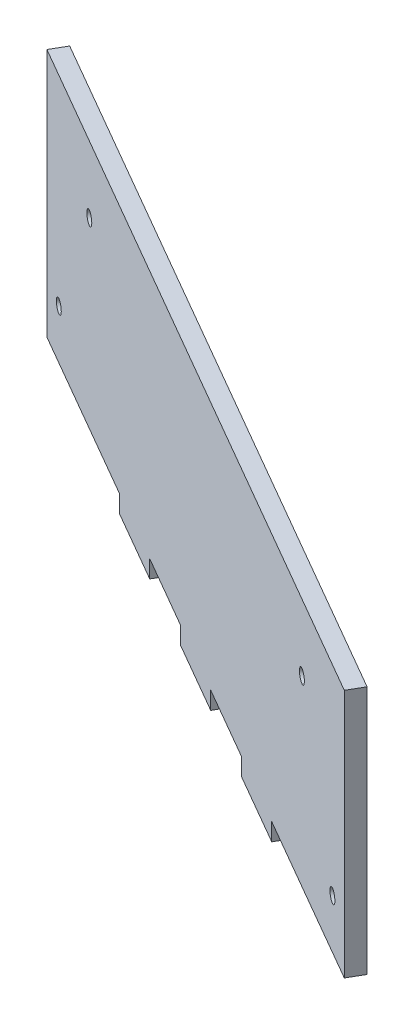
ISO-10303-21;
HEADER;
FILE_DESCRIPTION(('STEP AP214'),'2;1');
FILE_NAME('part.step','',(''),(''),'','','');
FILE_SCHEMA(('AUTOMOTIVE_DESIGN { 1 0 10303 214 1 1 1 1 }'));
ENDSEC;
DATA;
#1=APPLICATION_CONTEXT('core data for automotive mechanical design processes');
#2=APPLICATION_PROTOCOL_DEFINITION('international standard','automotive_design',2000,#1);
#3=PRODUCT_CONTEXT('',#1,'mechanical');
#4=PRODUCT('Part','Part','',(#3));
#5=PRODUCT_RELATED_PRODUCT_CATEGORY('part','',(#4));
#6=PRODUCT_DEFINITION_FORMATION('','',#4);
#7=PRODUCT_DEFINITION_CONTEXT('part definition',#1,'design');
#8=PRODUCT_DEFINITION('design','',#6,#7);
#9=PRODUCT_DEFINITION_SHAPE('','',#8);
#10=(LENGTH_UNIT() NAMED_UNIT(*) SI_UNIT(.MILLI.,.METRE.));
#11=(NAMED_UNIT(*) PLANE_ANGLE_UNIT() SI_UNIT($,.RADIAN.));
#12=(NAMED_UNIT(*) SI_UNIT($,.STERADIAN.) SOLID_ANGLE_UNIT());
#13=UNCERTAINTY_MEASURE_WITH_UNIT(LENGTH_MEASURE(1.E-05),#10,'distance_accuracy_value','');
#14=(GEOMETRIC_REPRESENTATION_CONTEXT(3) GLOBAL_UNCERTAINTY_ASSIGNED_CONTEXT((#13)) GLOBAL_UNIT_ASSIGNED_CONTEXT((#10,
#11,#12)) REPRESENTATION_CONTEXT('',''));
#15=CARTESIAN_POINT('',(0.,0.,0.));
#16=DIRECTION('',(0.,0.,1.));
#17=DIRECTION('',(1.,0.,0.));
#18=AXIS2_PLACEMENT_3D('',#15,#16,#17);
#19=CARTESIAN_POINT('',(187.283493649054,-89.75,-80.6153810567664));
#20=DIRECTION('',(0.866025403784438,0.,0.500000000000001));
#21=DIRECTION('',(0.500000000000001,0.,-0.866025403784438));
#22=AXIS2_PLACEMENT_3D('',#19,#20,#21);
#23=PLANE('',#22);
#24=DIRECTION('',(0.,-1.,0.));
#25=VECTOR('',#24,1.);
#26=CARTESIAN_POINT('',(189.783493649054,-89.75,-84.9455080756886));
#27=LINE('',#26,#25);
#28=CARTESIAN_POINT('',(189.783493649054,-15.,-84.9455080756886));
#29=VERTEX_POINT('',#28);
#30=CARTESIAN_POINT('',(189.783493649054,-89.75,-84.9455080756886));
#31=VERTEX_POINT('',#30);
#32=EDGE_CURVE('E141',#29,#31,#27,.T.);
#33=ORIENTED_EDGE('',*,*,#32,.F.);
#34=DIRECTION('',(0.500000000000001,0.,-0.866025403784438));
#35=VECTOR('',#34,1.);
#36=CARTESIAN_POINT('',(187.283493649054,-15.,-80.6153810567664));
#37=LINE('',#36,#35);
#38=CARTESIAN_POINT('',(187.283493649054,-15.,-80.6153810567664));
#39=VERTEX_POINT('',#38);
#40=EDGE_CURVE('E11',#39,#29,#37,.T.);
#41=ORIENTED_EDGE('',*,*,#40,.F.);
#42=DIRECTION('',(0.,-1.,0.));
#43=VECTOR('',#42,1.);
#44=CARTESIAN_POINT('',(187.283493649054,-89.75,-80.6153810567664));
#45=LINE('',#44,#43);
#46=CARTESIAN_POINT('',(187.283493649054,-89.75,-80.6153810567664));
#47=VERTEX_POINT('',#46);
#48=EDGE_CURVE('E164',#39,#47,#45,.T.);
#49=ORIENTED_EDGE('',*,*,#48,.T.);
#50=DIRECTION('',(0.500000000000001,0.,-0.866025403784438));
#51=VECTOR('',#50,1.);
#52=CARTESIAN_POINT('',(187.283493649054,-89.75,-80.6153810567664));
#53=LINE('',#52,#51);
#54=EDGE_CURVE('E90',#47,#31,#53,.T.);
#55=ORIENTED_EDGE('',*,*,#54,.T.);
#56=EDGE_LOOP('',(#33,#41,#49,#55));
#57=FACE_BOUND('',#56,.T.);
#58=ADVANCED_FACE('F33',(#57),#23,.T.);
#59=CARTESIAN_POINT('',(187.283493649054,-15.,-80.6153810567664));
#60=DIRECTION('',(0.,1.,0.));
#61=DIRECTION('',(0.,0.,1.));
#62=AXIS2_PLACEMENT_3D('',#59,#60,#61);
#63=PLANE('',#62);
#64=DIRECTION('',(0.866025403784438,0.,0.500000000000001));
#65=VECTOR('',#64,1.);
#66=CARTESIAN_POINT('',(189.783493649054,-15.,-84.9455080756886));
#67=LINE('',#66,#65);
#68=CARTESIAN_POINT('',(-21.3267788936041,-15.,-206.830080756888));
#69=VERTEX_POINT('',#68);
#70=EDGE_CURVE('E162',#69,#29,#67,.T.);
#71=ORIENTED_EDGE('',*,*,#70,.F.);
#72=DIRECTION('',(0.500000000000001,0.,-0.866025403784438));
#73=VECTOR('',#72,1.);
#74=CARTESIAN_POINT('',(-23.8267788936041,-15.,-202.499953737965));
#75=LINE('',#74,#73);
#76=CARTESIAN_POINT('',(-23.8267788936041,-15.,-202.499953737965));
#77=VERTEX_POINT('',#76);
#78=EDGE_CURVE('E186',#77,#69,#75,.T.);
#79=ORIENTED_EDGE('',*,*,#78,.F.);
#80=DIRECTION('',(0.866025403784438,0.,0.500000000000001));
#81=VECTOR('',#80,1.);
#82=CARTESIAN_POINT('',(187.283493649054,-15.,-80.6153810567664));
#83=LINE('',#82,#81);
#84=EDGE_CURVE('E139',#77,#39,#83,.T.);
#85=ORIENTED_EDGE('',*,*,#84,.T.);
#86=ORIENTED_EDGE('',*,*,#40,.T.);
#87=EDGE_LOOP('',(#71,#79,#85,#86));
#88=FACE_BOUND('',#87,.T.);
#89=ADVANCED_FACE('F218',(#88),#63,.T.);
#90=CARTESIAN_POINT('',(92.4670723846508,-95.,-135.357667397367));
#91=DIRECTION('',(0.,-1.,0.));
#92=DIRECTION('',(0.,0.,-1.));
#93=AXIS2_PLACEMENT_3D('',#90,#91,#92);
#94=PLANE('',#93);
#95=DIRECTION('',(-0.866025403784439,0.,-0.5));
#96=VECTOR('',#95,1.);
#97=CARTESIAN_POINT('',(94.9670723846508,-95.,-139.687794416289));
#98=LINE('',#97,#96);
#99=CARTESIAN_POINT('',(94.9670723846508,-95.,-139.687794416289));
#100=VERTEX_POINT('',#99);
#101=CARTESIAN_POINT('',(73.489642370799,-95.,-152.087794416287));
#102=VERTEX_POINT('',#101);
#103=EDGE_CURVE('E159',#100,#102,#98,.T.);
#104=ORIENTED_EDGE('',*,*,#103,.F.);
#105=DIRECTION('',(0.500000000000001,0.,-0.866025403784438));
#106=VECTOR('',#105,1.);
#107=CARTESIAN_POINT('',(92.4670723846508,-95.,-135.357667397367));
#108=LINE('',#107,#106);
#109=CARTESIAN_POINT('',(92.4670723846508,-95.,-135.357667397367));
#110=VERTEX_POINT('',#109);
#111=EDGE_CURVE('E42',#110,#100,#108,.T.);
#112=ORIENTED_EDGE('',*,*,#111,.F.);
#113=DIRECTION('',(-0.866025403784439,0.,-0.5));
#114=VECTOR('',#113,1.);
#115=CARTESIAN_POINT('',(92.4670723846508,-95.,-135.357667397367));
#116=LINE('',#115,#114);
#117=CARTESIAN_POINT('',(70.989642370799,-95.,-147.757667397365));
#118=VERTEX_POINT('',#117);
#119=EDGE_CURVE('E129',#110,#118,#116,.T.);
#120=ORIENTED_EDGE('',*,*,#119,.T.);
#121=DIRECTION('',(0.500000000000001,0.,-0.866025403784438));
#122=VECTOR('',#121,1.);
#123=CARTESIAN_POINT('',(70.989642370799,-95.,-147.757667397365));
#124=LINE('',#123,#122);
#125=EDGE_CURVE('E228',#118,#102,#124,.T.);
#126=ORIENTED_EDGE('',*,*,#125,.T.);
#127=EDGE_LOOP('',(#104,#112,#120,#126));
#128=FACE_BOUND('',#127,.T.);
#129=ADVANCED_FACE('F310',(#128),#94,.T.);
#130=CARTESIAN_POINT('',(92.4670723846508,-89.75,-135.357667397367));
#131=DIRECTION('',(0.866025403784438,0.,0.500000000000001));
#132=DIRECTION('',(0.500000000000001,0.,-0.866025403784438));
#133=AXIS2_PLACEMENT_3D('',#130,#131,#132);
#134=PLANE('',#133);
#135=DIRECTION('',(0.,-1.,0.));
#136=VECTOR('',#135,1.);
#137=CARTESIAN_POINT('',(94.9670723846508,-89.75,-139.687794416289));
#138=LINE('',#137,#136);
#139=CARTESIAN_POINT('',(94.9670723846508,-89.75,-139.687794416289));
#140=VERTEX_POINT('',#139);
#141=EDGE_CURVE('E112',#140,#100,#138,.T.);
#142=ORIENTED_EDGE('',*,*,#141,.F.);
#143=DIRECTION('',(0.500000000000001,0.,-0.866025403784438));
#144=VECTOR('',#143,1.);
#145=CARTESIAN_POINT('',(92.4670723846508,-89.75,-135.357667397367));
#146=LINE('',#145,#144);
#147=CARTESIAN_POINT('',(92.4670723846508,-89.75,-135.357667397367));
#148=VERTEX_POINT('',#147);
#149=EDGE_CURVE('E107',#148,#140,#146,.T.);
#150=ORIENTED_EDGE('',*,*,#149,.F.);
#151=DIRECTION('',(0.,-1.,0.));
#152=VECTOR('',#151,1.);
#153=CARTESIAN_POINT('',(92.4670723846508,-89.75,-135.357667397367));
#154=LINE('',#153,#152);
#155=EDGE_CURVE('E110',#148,#110,#154,.T.);
#156=ORIENTED_EDGE('',*,*,#155,.T.);
#157=ORIENTED_EDGE('',*,*,#111,.T.);
#158=EDGE_LOOP('',(#142,#150,#156,#157));
#159=FACE_BOUND('',#158,.T.);
#160=ADVANCED_FACE('F109',(#159),#134,.T.);
#161=CARTESIAN_POINT('',(114.290912560019,-89.75,-122.757667397367));
#162=DIRECTION('',(0.,-1.,0.));
#163=DIRECTION('',(0.,0.,-1.));
#164=AXIS2_PLACEMENT_3D('',#161,#162,#163);
#165=PLANE('',#164);
#166=DIRECTION('',(-0.866025403784438,0.,-0.500000000000001));
#167=VECTOR('',#166,1.);
#168=CARTESIAN_POINT('',(116.790912560019,-89.75,-127.087794416289));
#169=LINE('',#168,#167);
#170=CARTESIAN_POINT('',(116.790912560019,-89.75,-127.087794416289));
#171=VERTEX_POINT('',#170);
#172=EDGE_CURVE('E156',#171,#140,#169,.T.);
#173=ORIENTED_EDGE('',*,*,#172,.F.);
#174=DIRECTION('',(0.500000000000001,0.,-0.866025403784438));
#175=VECTOR('',#174,1.);
#176=CARTESIAN_POINT('',(114.290912560019,-89.75,-122.757667397367));
#177=LINE('',#176,#175);
#178=CARTESIAN_POINT('',(114.290912560019,-89.75,-122.757667397367));
#179=VERTEX_POINT('',#178);
#180=EDGE_CURVE('E117',#179,#171,#177,.T.);
#181=ORIENTED_EDGE('',*,*,#180,.F.);
#182=DIRECTION('',(-0.866025403784438,0.,-0.500000000000001));
#183=VECTOR('',#182,1.);
#184=CARTESIAN_POINT('',(114.290912560019,-89.75,-122.757667397367));
#185=LINE('',#184,#183);
#186=EDGE_CURVE('E125',#179,#148,#185,.T.);
#187=ORIENTED_EDGE('',*,*,#186,.T.);
#188=ORIENTED_EDGE('',*,*,#149,.T.);
#189=EDGE_LOOP('',(#173,#181,#187,#188));
#190=FACE_BOUND('',#189,.T.);
#191=ADVANCED_FACE('F131',(#190),#165,.T.);
#192=CARTESIAN_POINT('',(114.290912560019,-95.,-122.757667397367));
#193=DIRECTION('',(-0.866025403784438,0.,-0.500000000000001));
#194=DIRECTION('',(-0.500000000000001,0.,0.866025403784438));
#195=AXIS2_PLACEMENT_3D('',#192,#193,#194);
#196=PLANE('',#195);
#197=DIRECTION('',(0.,1.,0.));
#198=VECTOR('',#197,1.);
#199=CARTESIAN_POINT('',(116.790912560019,-95.,-127.087794416289));
#200=LINE('',#199,#198);
#201=CARTESIAN_POINT('',(116.790912560019,-95.,-127.087794416289));
#202=VERTEX_POINT('',#201);
#203=EDGE_CURVE('E153',#202,#171,#200,.T.);
#204=ORIENTED_EDGE('',*,*,#203,.F.);
#205=DIRECTION('',(0.500000000000001,0.,-0.866025403784438));
#206=VECTOR('',#205,1.);
#207=CARTESIAN_POINT('',(114.290912560019,-95.,-122.757667397367));
#208=LINE('',#207,#206);
#209=CARTESIAN_POINT('',(114.290912560019,-95.,-122.757667397367));
#210=VERTEX_POINT('',#209);
#211=EDGE_CURVE('E168',#210,#202,#208,.T.);
#212=ORIENTED_EDGE('',*,*,#211,.F.);
#213=DIRECTION('',(0.,1.,0.));
#214=VECTOR('',#213,1.);
#215=CARTESIAN_POINT('',(114.290912560019,-95.,-122.757667397367));
#216=LINE('',#215,#214);
#217=EDGE_CURVE('E132',#210,#179,#216,.T.);
#218=ORIENTED_EDGE('',*,*,#217,.T.);
#219=ORIENTED_EDGE('',*,*,#180,.T.);
#220=EDGE_LOOP('',(#204,#212,#218,#219));
#221=FACE_BOUND('',#220,.T.);
#222=ADVANCED_FACE('F363',(#221),#196,.T.);
#223=CARTESIAN_POINT('',(135.768342573873,-95.,-110.357667397367));
#224=DIRECTION('',(0.,-1.,0.));
#225=DIRECTION('',(0.,0.,-1.));
#226=AXIS2_PLACEMENT_3D('',#223,#224,#225);
#227=PLANE('',#226);
#228=DIRECTION('',(-0.866025403784438,0.,-0.500000000000001));
#229=VECTOR('',#228,1.);
#230=CARTESIAN_POINT('',(138.268342573873,-95.,-114.687794416289));
#231=LINE('',#230,#229);
#232=CARTESIAN_POINT('',(138.268342573873,-95.,-114.687794416289));
#233=VERTEX_POINT('',#232);
#234=EDGE_CURVE('E150',#233,#202,#231,.T.);
#235=ORIENTED_EDGE('',*,*,#234,.F.);
#236=DIRECTION('',(0.500000000000001,0.,-0.866025403784438));
#237=VECTOR('',#236,1.);
#238=CARTESIAN_POINT('',(135.768342573873,-95.,-110.357667397367));
#239=LINE('',#238,#237);
#240=CARTESIAN_POINT('',(135.768342573873,-95.,-110.357667397367));
#241=VERTEX_POINT('',#240);
#242=EDGE_CURVE('E170',#241,#233,#239,.T.);
#243=ORIENTED_EDGE('',*,*,#242,.F.);
#244=DIRECTION('',(-0.866025403784438,0.,-0.500000000000001));
#245=VECTOR('',#244,1.);
#246=CARTESIAN_POINT('',(135.768342573873,-95.,-110.357667397367));
#247=LINE('',#246,#245);
#248=EDGE_CURVE('E134',#241,#210,#247,.T.);
#249=ORIENTED_EDGE('',*,*,#248,.T.);
#250=ORIENTED_EDGE('',*,*,#211,.T.);
#251=EDGE_LOOP('',(#235,#243,#249,#250));
#252=FACE_BOUND('',#251,.T.);
#253=ADVANCED_FACE('F201',(#252),#227,.T.);
#254=CARTESIAN_POINT('',(135.768342573873,-95.,-110.357667397367));
#255=DIRECTION('',(0.866025403784438,0.,0.500000000000001));
#256=DIRECTION('',(0.500000000000001,0.,-0.866025403784438));
#257=AXIS2_PLACEMENT_3D('',#254,#255,#256);
#258=PLANE('',#257);
#259=DIRECTION('',(0.,-1.,0.));
#260=VECTOR('',#259,1.);
#261=CARTESIAN_POINT('',(138.268342573873,-95.,-114.687794416289));
#262=LINE('',#261,#260);
#263=CARTESIAN_POINT('',(138.268342573873,-89.75,-114.687794416289));
#264=VERTEX_POINT('',#263);
#265=EDGE_CURVE('E147',#264,#233,#262,.T.);
#266=ORIENTED_EDGE('',*,*,#265,.F.);
#267=DIRECTION('',(0.500000000000001,0.,-0.866025403784438));
#268=VECTOR('',#267,1.);
#269=CARTESIAN_POINT('',(135.768342573873,-89.75,-110.357667397367));
#270=LINE('',#269,#268);
#271=CARTESIAN_POINT('',(135.768342573873,-89.75,-110.357667397367));
#272=VERTEX_POINT('',#271);
#273=EDGE_CURVE('E172',#272,#264,#270,.T.);
#274=ORIENTED_EDGE('',*,*,#273,.F.);
#275=DIRECTION('',(0.,-1.,0.));
#276=VECTOR('',#275,1.);
#277=CARTESIAN_POINT('',(135.768342573873,-95.,-110.357667397367));
#278=LINE('',#277,#276);
#279=EDGE_CURVE('E195',#272,#241,#278,.T.);
#280=ORIENTED_EDGE('',*,*,#279,.T.);
#281=ORIENTED_EDGE('',*,*,#242,.T.);
#282=EDGE_LOOP('',(#266,#274,#280,#281));
#283=FACE_BOUND('',#282,.T.);
#284=ADVANCED_FACE('F206',(#283),#258,.T.);
#285=CARTESIAN_POINT('',(187.283493649054,-89.75,-80.6153810567664));
#286=DIRECTION('',(0.,-1.,0.));
#287=DIRECTION('',(0.,0.,-1.));
#288=AXIS2_PLACEMENT_3D('',#285,#286,#287);
#289=PLANE('',#288);
#290=DIRECTION('',(-0.866025403784438,0.,-0.500000000000001));
#291=VECTOR('',#290,1.);
#292=CARTESIAN_POINT('',(189.783493649054,-89.75,-84.9455080756886));
#293=LINE('',#292,#291);
#294=EDGE_CURVE('E144',#31,#264,#293,.T.);
#295=ORIENTED_EDGE('',*,*,#294,.F.);
#296=ORIENTED_EDGE('',*,*,#54,.F.);
#297=DIRECTION('',(-0.866025403784438,0.,-0.500000000000001));
#298=VECTOR('',#297,1.);
#299=CARTESIAN_POINT('',(187.283493649054,-89.75,-80.6153810567664));
#300=LINE('',#299,#298);
#301=EDGE_CURVE('E193',#47,#272,#300,.T.);
#302=ORIENTED_EDGE('',*,*,#301,.T.);
#303=ORIENTED_EDGE('',*,*,#273,.T.);
#304=EDGE_LOOP('',(#295,#296,#302,#303));
#305=FACE_BOUND('',#304,.T.);
#306=ADVANCED_FACE('F207',(#305),#289,.T.);
#307=CARTESIAN_POINT('',(81.7283573777249,0.,-141.557667397366));
#308=DIRECTION('',(-0.500000000000001,0.,0.866025403784438));
#309=DIRECTION('',(0.866025403784438,0.,0.500000000000001));
#310=AXIS2_PLACEMENT_3D('',#307,#308,#309);
#311=PLANE('',#310);
#312=CARTESIAN_POINT('',(178.839745962156,-75.,-85.4903810567665));
#313=DIRECTION('',(-0.500000000000001,0.,0.866025403784438));
#314=DIRECTION('',(0.866025403784438,0.,0.500000000000001));
#315=AXIS2_PLACEMENT_3D('',#312,#313,#314);
#316=CIRCLE('',#315,2.);
#317=CARTESIAN_POINT('',(180.571796769725,-75.,-84.4903810567665));
#318=VERTEX_POINT('',#317);
#319=EDGE_CURVE('E176',#318,#318,#316,.T.);
#320=ORIENTED_EDGE('',*,*,#319,.F.);
#321=EDGE_LOOP('',(#320));
#322=FACE_BOUND('',#321,.T.);
#323=CARTESIAN_POINT('',(157.189110867545,-35.,-97.9903810567665));
#324=DIRECTION('',(-0.500000000000001,0.,0.866025403784438));
#325=DIRECTION('',(0.866025403784438,0.,0.500000000000001));
#326=AXIS2_PLACEMENT_3D('',#323,#324,#325);
#327=CIRCLE('',#326,2.);
#328=CARTESIAN_POINT('',(158.921161675113,-35.,-96.9903810567665));
#329=VERTEX_POINT('',#328);
#330=EDGE_CURVE('E181',#329,#329,#327,.T.);
#331=ORIENTED_EDGE('',*,*,#330,.F.);
#332=EDGE_LOOP('',(#331));
#333=FACE_BOUND('',#332,.T.);
#334=ORIENTED_EDGE('',*,*,#48,.F.);
#335=ORIENTED_EDGE('',*,*,#84,.F.);
#336=DIRECTION('',(0.,-1.,0.));
#337=VECTOR('',#336,1.);
#338=CARTESIAN_POINT('',(-23.8267788936041,-89.75,-202.499953737965));
#339=LINE('',#338,#337);
#340=CARTESIAN_POINT('',(-23.8267788936041,-89.75,-202.499953737965));
#341=VERTEX_POINT('',#340);
#342=EDGE_CURVE('E227',#77,#341,#339,.T.);
#343=ORIENTED_EDGE('',*,*,#342,.T.);
#344=DIRECTION('',(0.866025403784438,0.,0.500000000000001));
#345=VECTOR('',#344,1.);
#346=CARTESIAN_POINT('',(-23.8267788936041,-89.75,-202.499953737965));
#347=LINE('',#346,#345);
#348=CARTESIAN_POINT('',(27.6883721815771,-89.75,-172.757667397365));
#349=VERTEX_POINT('',#348);
#350=EDGE_CURVE('E268',#341,#349,#347,.T.);
#351=ORIENTED_EDGE('',*,*,#350,.T.);
#352=DIRECTION('',(0.,-1.,0.));
#353=VECTOR('',#352,1.);
#354=CARTESIAN_POINT('',(27.6883721815771,-95.,-172.757667397365));
#355=LINE('',#354,#353);
#356=CARTESIAN_POINT('',(27.6883721815771,-95.,-172.757667397365));
#357=VERTEX_POINT('',#356);
#358=EDGE_CURVE('E271',#349,#357,#355,.T.);
#359=ORIENTED_EDGE('',*,*,#358,.T.);
#360=DIRECTION('',(0.866025403784438,0.,0.500000000000001));
#361=VECTOR('',#360,1.);
#362=CARTESIAN_POINT('',(27.6883721815771,-95.,-172.757667397365));
#363=LINE('',#362,#361);
#364=CARTESIAN_POINT('',(49.1658021954311,-95.,-160.357667397365));
#365=VERTEX_POINT('',#364);
#366=EDGE_CURVE('E274',#357,#365,#363,.T.);
#367=ORIENTED_EDGE('',*,*,#366,.T.);
#368=DIRECTION('',(0.,1.,0.));
#369=VECTOR('',#368,1.);
#370=CARTESIAN_POINT('',(49.1658021954311,-95.,-160.357667397365));
#371=LINE('',#370,#369);
#372=CARTESIAN_POINT('',(49.1658021954311,-89.75,-160.357667397365));
#373=VERTEX_POINT('',#372);
#374=EDGE_CURVE('E277',#365,#373,#371,.T.);
#375=ORIENTED_EDGE('',*,*,#374,.T.);
#376=DIRECTION('',(0.866025403784438,0.,0.5));
#377=VECTOR('',#376,1.);
#378=CARTESIAN_POINT('',(49.1658021954311,-89.75,-160.357667397365));
#379=LINE('',#378,#377);
#380=CARTESIAN_POINT('',(70.989642370799,-89.75,-147.757667397365));
#381=VERTEX_POINT('',#380);
#382=EDGE_CURVE('E280',#373,#381,#379,.T.);
#383=ORIENTED_EDGE('',*,*,#382,.T.);
#384=DIRECTION('',(0.,-1.,0.));
#385=VECTOR('',#384,1.);
#386=CARTESIAN_POINT('',(70.989642370799,-89.75,-147.757667397365));
#387=LINE('',#386,#385);
#388=EDGE_CURVE('E253',#381,#118,#387,.T.);
#389=ORIENTED_EDGE('',*,*,#388,.T.);
#390=ORIENTED_EDGE('',*,*,#119,.F.);
#391=ORIENTED_EDGE('',*,*,#155,.F.);
#392=ORIENTED_EDGE('',*,*,#186,.F.);
#393=ORIENTED_EDGE('',*,*,#217,.F.);
#394=ORIENTED_EDGE('',*,*,#248,.F.);
#395=ORIENTED_EDGE('',*,*,#279,.F.);
#396=ORIENTED_EDGE('',*,*,#301,.F.);
#397=EDGE_LOOP('',(#334,#335,#343,#351,#359,#367,#375,#383,#389,#390,#391,#392,#393,#394,#395,#396));
#398=FACE_BOUND('',#397,.T.);
#399=CARTESIAN_POINT('',(-15.3830312067058,-75.,-197.624953737965));
#400=DIRECTION('',(0.500000000000001,0.,-0.866025403784438));
#401=DIRECTION('',(-0.866025403784438,0.,-0.500000000000001));
#402=AXIS2_PLACEMENT_3D('',#399,#400,#401);
#403=CIRCLE('',#402,2.);
#404=CARTESIAN_POINT('',(-17.1150820142746,-75.,-198.624953737965));
#405=VERTEX_POINT('',#404);
#406=EDGE_CURVE('E256',#405,#405,#403,.T.);
#407=ORIENTED_EDGE('',*,*,#406,.T.);
#408=EDGE_LOOP('',(#407));
#409=FACE_BOUND('',#408,.T.);
#410=CARTESIAN_POINT('',(6.26760388790525,-35.,-185.124953737965));
#411=DIRECTION('',(0.500000000000001,0.,-0.866025403784438));
#412=DIRECTION('',(-0.866025403784438,0.,-0.500000000000001));
#413=AXIS2_PLACEMENT_3D('',#410,#411,#412);
#414=CIRCLE('',#413,2.);
#415=CARTESIAN_POINT('',(4.53555308033637,-35.,-186.124953737965));
#416=VERTEX_POINT('',#415);
#417=EDGE_CURVE('E261',#416,#416,#414,.T.);
#418=ORIENTED_EDGE('',*,*,#417,.T.);
#419=EDGE_LOOP('',(#418));
#420=FACE_BOUND('',#419,.T.);
#421=ADVANCED_FACE('F122',(#322,#333,#398,#409,#420),#311,.T.);
#422=CARTESIAN_POINT('',(84.2283573777249,0.,-145.887794416288));
#423=DIRECTION('',(-0.500000000000001,0.,0.866025403784438));
#424=DIRECTION('',(0.866025403784438,0.,0.500000000000001));
#425=AXIS2_PLACEMENT_3D('',#422,#423,#424);
#426=PLANE('',#425);
#427=CARTESIAN_POINT('',(181.339745962156,-75.,-89.8205080756887));
#428=DIRECTION('',(-0.500000000000001,0.,0.866025403784438));
#429=DIRECTION('',(0.866025403784438,0.,0.500000000000001));
#430=AXIS2_PLACEMENT_3D('',#427,#428,#429);
#431=CIRCLE('',#430,2.);
#432=CARTESIAN_POINT('',(183.071796769725,-75.,-88.8205080756886));
#433=VERTEX_POINT('',#432);
#434=EDGE_CURVE('E36',#433,#433,#431,.T.);
#435=ORIENTED_EDGE('',*,*,#434,.T.);
#436=EDGE_LOOP('',(#435));
#437=FACE_BOUND('',#436,.T.);
#438=CARTESIAN_POINT('',(159.689110867545,-35.,-102.320508075689));
#439=DIRECTION('',(-0.500000000000001,0.,0.866025403784438));
#440=DIRECTION('',(0.866025403784438,0.,0.500000000000001));
#441=AXIS2_PLACEMENT_3D('',#438,#439,#440);
#442=CIRCLE('',#441,2.);
#443=CARTESIAN_POINT('',(161.421161675113,-35.,-101.320508075689));
#444=VERTEX_POINT('',#443);
#445=EDGE_CURVE('E174',#444,#444,#442,.T.);
#446=ORIENTED_EDGE('',*,*,#445,.T.);
#447=EDGE_LOOP('',(#446));
#448=FACE_BOUND('',#447,.T.);
#449=ORIENTED_EDGE('',*,*,#32,.T.);
#450=ORIENTED_EDGE('',*,*,#294,.T.);
#451=ORIENTED_EDGE('',*,*,#265,.T.);
#452=ORIENTED_EDGE('',*,*,#234,.T.);
#453=ORIENTED_EDGE('',*,*,#203,.T.);
#454=ORIENTED_EDGE('',*,*,#172,.T.);
#455=ORIENTED_EDGE('',*,*,#141,.T.);
#456=ORIENTED_EDGE('',*,*,#103,.T.);
#457=DIRECTION('',(0.,-1.,0.));
#458=VECTOR('',#457,1.);
#459=CARTESIAN_POINT('',(73.489642370799,-89.75,-152.087794416287));
#460=LINE('',#459,#458);
#461=CARTESIAN_POINT('',(73.489642370799,-89.75,-152.087794416287));
#462=VERTEX_POINT('',#461);
#463=EDGE_CURVE('E234',#462,#102,#460,.T.);
#464=ORIENTED_EDGE('',*,*,#463,.F.);
#465=DIRECTION('',(0.866025403784438,0.,0.5));
#466=VECTOR('',#465,1.);
#467=CARTESIAN_POINT('',(51.6658021954311,-89.75,-164.687794416288));
#468=LINE('',#467,#466);
#469=CARTESIAN_POINT('',(51.6658021954311,-89.75,-164.687794416288));
#470=VERTEX_POINT('',#469);
#471=EDGE_CURVE('E296',#470,#462,#468,.T.);
#472=ORIENTED_EDGE('',*,*,#471,.F.);
#473=DIRECTION('',(0.,1.,0.));
#474=VECTOR('',#473,1.);
#475=CARTESIAN_POINT('',(51.6658021954311,-95.,-164.687794416288));
#476=LINE('',#475,#474);
#477=CARTESIAN_POINT('',(51.6658021954311,-95.,-164.687794416288));
#478=VERTEX_POINT('',#477);
#479=EDGE_CURVE('E294',#478,#470,#476,.T.);
#480=ORIENTED_EDGE('',*,*,#479,.F.);
#481=DIRECTION('',(0.866025403784438,0.,0.500000000000001));
#482=VECTOR('',#481,1.);
#483=CARTESIAN_POINT('',(30.1883721815771,-95.,-177.087794416288));
#484=LINE('',#483,#482);
#485=CARTESIAN_POINT('',(30.1883721815771,-95.,-177.087794416288));
#486=VERTEX_POINT('',#485);
#487=EDGE_CURVE('E291',#486,#478,#484,.T.);
#488=ORIENTED_EDGE('',*,*,#487,.F.);
#489=DIRECTION('',(0.,-1.,0.));
#490=VECTOR('',#489,1.);
#491=CARTESIAN_POINT('',(30.1883721815771,-95.,-177.087794416288));
#492=LINE('',#491,#490);
#493=CARTESIAN_POINT('',(30.1883721815771,-89.75,-177.087794416288));
#494=VERTEX_POINT('',#493);
#495=EDGE_CURVE('E288',#494,#486,#492,.T.);
#496=ORIENTED_EDGE('',*,*,#495,.F.);
#497=DIRECTION('',(0.866025403784438,0.,0.500000000000001));
#498=VECTOR('',#497,1.);
#499=CARTESIAN_POINT('',(-21.3267788936041,-89.75,-206.830080756888));
#500=LINE('',#499,#498);
#501=CARTESIAN_POINT('',(-21.3267788936041,-89.75,-206.830080756888));
#502=VERTEX_POINT('',#501);
#503=EDGE_CURVE('E285',#502,#494,#500,.T.);
#504=ORIENTED_EDGE('',*,*,#503,.F.);
#505=DIRECTION('',(0.,-1.,0.));
#506=VECTOR('',#505,1.);
#507=CARTESIAN_POINT('',(-21.3267788936041,-89.75,-206.830080756888));
#508=LINE('',#507,#506);
#509=EDGE_CURVE('E215',#69,#502,#508,.T.);
#510=ORIENTED_EDGE('',*,*,#509,.F.);
#511=ORIENTED_EDGE('',*,*,#70,.T.);
#512=EDGE_LOOP('',(#449,#450,#451,#452,#453,#454,#455,#456,#464,#472,#480,#488,#496,#504,#510,#511));
#513=FACE_BOUND('',#512,.T.);
#514=CARTESIAN_POINT('',(-12.8830312067058,-75.,-201.955080756888));
#515=DIRECTION('',(0.500000000000001,0.,-0.866025403784438));
#516=DIRECTION('',(-0.866025403784438,0.,-0.500000000000001));
#517=AXIS2_PLACEMENT_3D('',#514,#515,#516);
#518=CIRCLE('',#517,2.);
#519=CARTESIAN_POINT('',(-14.6150820142747,-75.,-202.955080756888));
#520=VERTEX_POINT('',#519);
#521=EDGE_CURVE('E189',#520,#520,#518,.T.);
#522=ORIENTED_EDGE('',*,*,#521,.F.);
#523=EDGE_LOOP('',(#522));
#524=FACE_BOUND('',#523,.T.);
#525=CARTESIAN_POINT('',(8.76760388790526,-35.,-189.455080756888));
#526=DIRECTION('',(0.500000000000001,0.,-0.866025403784438));
#527=DIRECTION('',(-0.866025403784438,0.,-0.500000000000001));
#528=AXIS2_PLACEMENT_3D('',#525,#526,#527);
#529=CIRCLE('',#528,2.);
#530=CARTESIAN_POINT('',(7.03555308033639,-35.,-190.455080756888));
#531=VERTEX_POINT('',#530);
#532=EDGE_CURVE('E254',#531,#531,#529,.T.);
#533=ORIENTED_EDGE('',*,*,#532,.F.);
#534=EDGE_LOOP('',(#533));
#535=FACE_BOUND('',#534,.T.);
#536=ADVANCED_FACE('F211',(#437,#448,#513,#524,#535),#426,.F.);
#537=CARTESIAN_POINT('',(193.632021523114,-35.,-161.111353887905));
#538=DIRECTION('',(-0.500000000000001,0.,0.866025403784438));
#539=DIRECTION('',(0.866025403784438,0.,0.500000000000001));
#540=AXIS2_PLACEMENT_3D('',#537,#538,#539);
#541=CYLINDRICAL_SURFACE('',#540,2.);
#542=ORIENTED_EDGE('',*,*,#330,.T.);
#543=EDGE_LOOP('',(#542));
#544=FACE_BOUND('',#543,.T.);
#545=ORIENTED_EDGE('',*,*,#445,.F.);
#546=EDGE_LOOP('',(#545));
#547=FACE_BOUND('',#546,.T.);
#548=ADVANCED_FACE('F378',(#544,#547),#541,.F.);
#549=CARTESIAN_POINT('',(215.282656617725,-75.,-148.611353887905));
#550=DIRECTION('',(-0.500000000000001,0.,0.866025403784438));
#551=DIRECTION('',(0.866025403784438,0.,0.500000000000001));
#552=AXIS2_PLACEMENT_3D('',#549,#550,#551);
#553=CYLINDRICAL_SURFACE('',#552,2.);
#554=ORIENTED_EDGE('',*,*,#319,.T.);
#555=EDGE_LOOP('',(#554));
#556=FACE_BOUND('',#555,.T.);
#557=ORIENTED_EDGE('',*,*,#434,.F.);
#558=EDGE_LOOP('',(#557));
#559=FACE_BOUND('',#558,.T.);
#560=ADVANCED_FACE('F384',(#556,#559),#553,.F.);
#561=CARTESIAN_POINT('',(-23.8267788936041,-89.75,-202.499953737965));
#562=DIRECTION('',(-0.866025403784438,0.,-0.500000000000001));
#563=DIRECTION('',(0.500000000000001,0.,-0.866025403784438));
#564=AXIS2_PLACEMENT_3D('',#561,#562,#563);
#565=PLANE('',#564);
#566=ORIENTED_EDGE('',*,*,#509,.T.);
#567=DIRECTION('',(0.500000000000001,0.,-0.866025403784438));
#568=VECTOR('',#567,1.);
#569=CARTESIAN_POINT('',(-23.8267788936041,-89.75,-202.499953737965));
#570=LINE('',#569,#568);
#571=EDGE_CURVE('E251',#341,#502,#570,.T.);
#572=ORIENTED_EDGE('',*,*,#571,.F.);
#573=ORIENTED_EDGE('',*,*,#342,.F.);
#574=ORIENTED_EDGE('',*,*,#78,.T.);
#575=EDGE_LOOP('',(#566,#572,#573,#574));
#576=FACE_BOUND('',#575,.T.);
#577=ADVANCED_FACE('F223',(#576),#565,.T.);
#578=CARTESIAN_POINT('',(70.989642370799,-89.75,-147.757667397365));
#579=DIRECTION('',(-0.866025403784438,0.,-0.500000000000001));
#580=DIRECTION('',(0.500000000000001,0.,-0.866025403784438));
#581=AXIS2_PLACEMENT_3D('',#578,#579,#580);
#582=PLANE('',#581);
#583=ORIENTED_EDGE('',*,*,#463,.T.);
#584=ORIENTED_EDGE('',*,*,#125,.F.);
#585=ORIENTED_EDGE('',*,*,#388,.F.);
#586=DIRECTION('',(0.500000000000001,0.,-0.866025403784438));
#587=VECTOR('',#586,1.);
#588=CARTESIAN_POINT('',(70.989642370799,-89.75,-147.757667397365));
#589=LINE('',#588,#587);
#590=EDGE_CURVE('E231',#381,#462,#589,.T.);
#591=ORIENTED_EDGE('',*,*,#590,.T.);
#592=EDGE_LOOP('',(#583,#584,#585,#591));
#593=FACE_BOUND('',#592,.T.);
#594=ADVANCED_FACE('F306',(#593),#582,.T.);
#595=CARTESIAN_POINT('',(49.1658021954311,-89.75,-160.357667397365));
#596=DIRECTION('',(0.,-1.,0.));
#597=DIRECTION('',(0.86602540378444,0.,-0.499999999999998));
#598=AXIS2_PLACEMENT_3D('',#595,#596,#597);
#599=PLANE('',#598);
#600=ORIENTED_EDGE('',*,*,#471,.T.);
#601=ORIENTED_EDGE('',*,*,#590,.F.);
#602=ORIENTED_EDGE('',*,*,#382,.F.);
#603=DIRECTION('',(0.500000000000001,0.,-0.866025403784438));
#604=VECTOR('',#603,1.);
#605=CARTESIAN_POINT('',(49.1658021954311,-89.75,-160.357667397365));
#606=LINE('',#605,#604);
#607=EDGE_CURVE('E239',#373,#470,#606,.T.);
#608=ORIENTED_EDGE('',*,*,#607,.T.);
#609=EDGE_LOOP('',(#600,#601,#602,#608));
#610=FACE_BOUND('',#609,.T.);
#611=ADVANCED_FACE('F337',(#610),#599,.T.);
#612=CARTESIAN_POINT('',(49.1658021954311,-95.,-160.357667397365));
#613=DIRECTION('',(0.866025403784438,0.,0.500000000000001));
#614=DIRECTION('',(-0.500000000000001,0.,0.866025403784438));
#615=AXIS2_PLACEMENT_3D('',#612,#613,#614);
#616=PLANE('',#615);
#617=ORIENTED_EDGE('',*,*,#479,.T.);
#618=ORIENTED_EDGE('',*,*,#607,.F.);
#619=ORIENTED_EDGE('',*,*,#374,.F.);
#620=DIRECTION('',(0.500000000000001,0.,-0.866025403784438));
#621=VECTOR('',#620,1.);
#622=CARTESIAN_POINT('',(49.1658021954311,-95.,-160.357667397365));
#623=LINE('',#622,#621);
#624=EDGE_CURVE('E242',#365,#478,#623,.T.);
#625=ORIENTED_EDGE('',*,*,#624,.T.);
#626=EDGE_LOOP('',(#617,#618,#619,#625));
#627=FACE_BOUND('',#626,.T.);
#628=ADVANCED_FACE('F333',(#627),#616,.T.);
#629=CARTESIAN_POINT('',(27.6883721815771,-95.,-172.757667397365));
#630=DIRECTION('',(0.,-1.,0.));
#631=DIRECTION('',(0.86602540378444,0.,-0.499999999999998));
#632=AXIS2_PLACEMENT_3D('',#629,#630,#631);
#633=PLANE('',#632);
#634=ORIENTED_EDGE('',*,*,#487,.T.);
#635=ORIENTED_EDGE('',*,*,#624,.F.);
#636=ORIENTED_EDGE('',*,*,#366,.F.);
#637=DIRECTION('',(0.500000000000001,0.,-0.866025403784438));
#638=VECTOR('',#637,1.);
#639=CARTESIAN_POINT('',(27.6883721815771,-95.,-172.757667397365));
#640=LINE('',#639,#638);
#641=EDGE_CURVE('E245',#357,#486,#640,.T.);
#642=ORIENTED_EDGE('',*,*,#641,.T.);
#643=EDGE_LOOP('',(#634,#635,#636,#642));
#644=FACE_BOUND('',#643,.T.);
#645=ADVANCED_FACE('F344',(#644),#633,.T.);
#646=CARTESIAN_POINT('',(27.6883721815771,-95.,-172.757667397365));
#647=DIRECTION('',(-0.866025403784438,0.,-0.500000000000001));
#648=DIRECTION('',(0.500000000000001,0.,-0.866025403784438));
#649=AXIS2_PLACEMENT_3D('',#646,#647,#648);
#650=PLANE('',#649);
#651=ORIENTED_EDGE('',*,*,#495,.T.);
#652=ORIENTED_EDGE('',*,*,#641,.F.);
#653=ORIENTED_EDGE('',*,*,#358,.F.);
#654=DIRECTION('',(0.500000000000001,0.,-0.866025403784438));
#655=VECTOR('',#654,1.);
#656=CARTESIAN_POINT('',(27.6883721815771,-89.75,-172.757667397365));
#657=LINE('',#656,#655);
#658=EDGE_CURVE('E248',#349,#494,#657,.T.);
#659=ORIENTED_EDGE('',*,*,#658,.T.);
#660=EDGE_LOOP('',(#651,#652,#653,#659));
#661=FACE_BOUND('',#660,.T.);
#662=ADVANCED_FACE('F394',(#661),#650,.T.);
#663=CARTESIAN_POINT('',(-23.8267788936041,-89.75,-202.499953737965));
#664=DIRECTION('',(0.,-1.,0.));
#665=DIRECTION('',(0.86602540378444,0.,-0.499999999999998));
#666=AXIS2_PLACEMENT_3D('',#663,#664,#665);
#667=PLANE('',#666);
#668=ORIENTED_EDGE('',*,*,#503,.T.);
#669=ORIENTED_EDGE('',*,*,#658,.F.);
#670=ORIENTED_EDGE('',*,*,#350,.F.);
#671=ORIENTED_EDGE('',*,*,#571,.T.);
#672=EDGE_LOOP('',(#668,#669,#670,#671));
#673=FACE_BOUND('',#672,.T.);
#674=ADVANCED_FACE('F390',(#673),#667,.T.);
#675=CARTESIAN_POINT('',(42.7105145434744,-35.,-248.245926569104));
#676=DIRECTION('',(-0.500000000000001,0.,0.866025403784438));
#677=DIRECTION('',(-0.866025403784438,0.,-0.500000000000001));
#678=AXIS2_PLACEMENT_3D('',#675,#676,#677);
#679=CYLINDRICAL_SURFACE('',#678,2.);
#680=ORIENTED_EDGE('',*,*,#417,.F.);
#681=EDGE_LOOP('',(#680));
#682=FACE_BOUND('',#681,.T.);
#683=ORIENTED_EDGE('',*,*,#532,.T.);
#684=EDGE_LOOP('',(#683));
#685=FACE_BOUND('',#684,.T.);
#686=ADVANCED_FACE('F393',(#682,#685),#679,.F.);
#687=CARTESIAN_POINT('',(21.0598794488634,-75.,-260.745926569104));
#688=DIRECTION('',(-0.500000000000001,0.,0.866025403784438));
#689=DIRECTION('',(-0.866025403784438,0.,-0.500000000000001));
#690=AXIS2_PLACEMENT_3D('',#687,#688,#689);
#691=CYLINDRICAL_SURFACE('',#690,2.);
#692=ORIENTED_EDGE('',*,*,#406,.F.);
#693=EDGE_LOOP('',(#692));
#694=FACE_BOUND('',#693,.T.);
#695=ORIENTED_EDGE('',*,*,#521,.T.);
#696=EDGE_LOOP('',(#695));
#697=FACE_BOUND('',#696,.T.);
#698=ADVANCED_FACE('F434',(#694,#697),#691,.F.);
#699=CLOSED_SHELL('',(#58,#89,#129,#160,#191,#222,#253,#284,#306,#421,#536,#548,#560,#577,#594,
#611,#628,#645,#662,#674,#686,#698));
#700=MANIFOLD_SOLID_BREP('B2',#699);
#701=ADVANCED_BREP_SHAPE_REPRESENTATION('',(#18,#700),#14);
#702=SHAPE_DEFINITION_REPRESENTATION(#9,#701);
ENDSEC;
END-ISO-10303-21;
